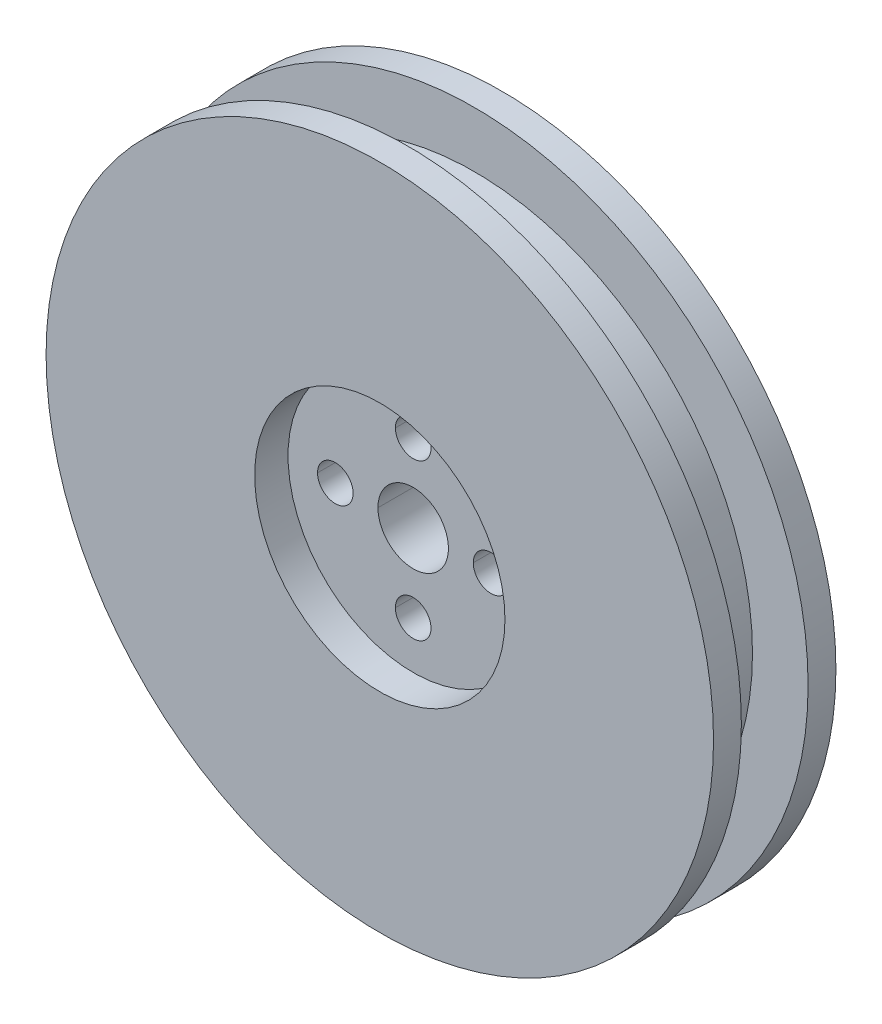
ISO-10303-21;
HEADER;
FILE_DESCRIPTION(('STEP AP214'),'2;1');
FILE_NAME('part.step','',(''),(''),'','','');
FILE_SCHEMA(('AUTOMOTIVE_DESIGN { 1 0 10303 214 1 1 1 1 }'));
ENDSEC;
DATA;
#1=APPLICATION_CONTEXT('core data for automotive mechanical design processes');
#2=APPLICATION_PROTOCOL_DEFINITION('international standard','automotive_design',2000,#1);
#3=PRODUCT_CONTEXT('',#1,'mechanical');
#4=PRODUCT('Part','Part','',(#3));
#5=PRODUCT_RELATED_PRODUCT_CATEGORY('part','',(#4));
#6=PRODUCT_DEFINITION_FORMATION('','',#4);
#7=PRODUCT_DEFINITION_CONTEXT('part definition',#1,'design');
#8=PRODUCT_DEFINITION('design','',#6,#7);
#9=PRODUCT_DEFINITION_SHAPE('','',#8);
#10=(LENGTH_UNIT() NAMED_UNIT(*) SI_UNIT(.MILLI.,.METRE.));
#11=(NAMED_UNIT(*) PLANE_ANGLE_UNIT() SI_UNIT($,.RADIAN.));
#12=(NAMED_UNIT(*) SI_UNIT($,.STERADIAN.) SOLID_ANGLE_UNIT());
#13=UNCERTAINTY_MEASURE_WITH_UNIT(LENGTH_MEASURE(1.E-05),#10,'distance_accuracy_value','');
#14=(GEOMETRIC_REPRESENTATION_CONTEXT(3) GLOBAL_UNCERTAINTY_ASSIGNED_CONTEXT((#13)) GLOBAL_UNIT_ASSIGNED_CONTEXT((#10,
#11,#12)) REPRESENTATION_CONTEXT('',''));
#15=CARTESIAN_POINT('',(0.,0.,0.));
#16=DIRECTION('',(0.,0.,1.));
#17=DIRECTION('',(1.,0.,0.));
#18=AXIS2_PLACEMENT_3D('',#15,#16,#17);
#19=CARTESIAN_POINT('',(0.,0.,-16.));
#20=DIRECTION('',(0.,0.,1.));
#21=DIRECTION('',(1.,0.,0.));
#22=AXIS2_PLACEMENT_3D('',#19,#20,#21);
#23=CYLINDRICAL_SURFACE('',#22,3.16810248006077);
#24=CARTESIAN_POINT('',(0.,0.,3.));
#25=DIRECTION('',(0.,0.,-1.));
#26=DIRECTION('',(-1.,0.,0.));
#27=AXIS2_PLACEMENT_3D('',#24,#25,#26);
#28=CIRCLE('',#27,3.16810248006077);
#29=CARTESIAN_POINT('',(-3.16810248006077,0.,3.));
#30=VERTEX_POINT('',#29);
#31=CARTESIAN_POINT('',(3.16810248006077,0.,3.));
#32=VERTEX_POINT('',#31);
#33=EDGE_CURVE('E56',#30,#32,#28,.F.);
#34=ORIENTED_EDGE('',*,*,#33,.F.);
#35=DIRECTION('',(0.,0.,1.));
#36=VECTOR('',#35,1.);
#37=CARTESIAN_POINT('',(-3.16810248006077,0.,-16.));
#38=LINE('',#37,#36);
#39=CARTESIAN_POINT('',(-3.16810248006077,0.,8.));
#40=VERTEX_POINT('',#39);
#41=EDGE_CURVE('E179',#30,#40,#38,.T.);
#42=ORIENTED_EDGE('',*,*,#41,.T.);
#43=CARTESIAN_POINT('',(0.,0.,8.));
#44=DIRECTION('',(0.,0.,-1.));
#45=DIRECTION('',(1.,0.,0.));
#46=AXIS2_PLACEMENT_3D('',#43,#44,#45);
#47=CIRCLE('',#46,3.16810248006077);
#48=CARTESIAN_POINT('',(3.16810248006077,0.,8.));
#49=VERTEX_POINT('',#48);
#50=EDGE_CURVE('E171',#49,#40,#47,.T.);
#51=ORIENTED_EDGE('',*,*,#50,.F.);
#52=DIRECTION('',(0.,0.,1.));
#53=VECTOR('',#52,1.);
#54=CARTESIAN_POINT('',(3.16810248006077,0.,-16.));
#55=LINE('',#54,#53);
#56=EDGE_CURVE('E43',#32,#49,#55,.T.);
#57=ORIENTED_EDGE('',*,*,#56,.F.);
#58=EDGE_LOOP('',(#34,#42,#51,#57));
#59=FACE_BOUND('',#58,.T.);
#60=ADVANCED_FACE('F39',(#59),#23,.F.);
#61=EDGE_CURVE('E222',#32,#30,#28,.F.);
#62=ORIENTED_EDGE('',*,*,#61,.F.);
#63=ORIENTED_EDGE('',*,*,#56,.T.);
#64=CARTESIAN_POINT('',(0.,0.,8.));
#65=DIRECTION('',(0.,0.,-1.));
#66=DIRECTION('',(1.,0.,0.));
#67=AXIS2_PLACEMENT_3D('',#64,#65,#66);
#68=CIRCLE('',#67,3.16810248006077);
#69=EDGE_CURVE('E188',#40,#49,#68,.T.);
#70=ORIENTED_EDGE('',*,*,#69,.F.);
#71=ORIENTED_EDGE('',*,*,#41,.F.);
#72=EDGE_LOOP('',(#62,#63,#70,#71));
#73=FACE_BOUND('',#72,.T.);
#74=ADVANCED_FACE('F221',(#73),#23,.F.);
#75=CARTESIAN_POINT('',(-7.,0.,-16.));
#76=DIRECTION('',(0.,0.,1.));
#77=DIRECTION('',(1.,0.,0.));
#78=AXIS2_PLACEMENT_3D('',#75,#76,#77);
#79=CYLINDRICAL_SURFACE('',#78,1.6);
#80=CARTESIAN_POINT('',(-7.,0.,3.));
#81=DIRECTION('',(0.,0.,-1.));
#82=DIRECTION('',(-1.,0.,0.));
#83=AXIS2_PLACEMENT_3D('',#80,#81,#82);
#84=CIRCLE('',#83,1.6);
#85=CARTESIAN_POINT('',(-5.4,0.,3.));
#86=VERTEX_POINT('',#85);
#87=CARTESIAN_POINT('',(-8.6,0.,3.));
#88=VERTEX_POINT('',#87);
#89=EDGE_CURVE('E63',#86,#88,#84,.F.);
#90=ORIENTED_EDGE('',*,*,#89,.F.);
#91=DIRECTION('',(0.,0.,1.));
#92=VECTOR('',#91,1.);
#93=CARTESIAN_POINT('',(-5.4,0.,-16.));
#94=LINE('',#93,#92);
#95=CARTESIAN_POINT('',(-5.4,0.,8.));
#96=VERTEX_POINT('',#95);
#97=EDGE_CURVE('E180',#86,#96,#94,.T.);
#98=ORIENTED_EDGE('',*,*,#97,.T.);
#99=CARTESIAN_POINT('',(-7.,0.,8.));
#100=DIRECTION('',(0.,0.,-1.));
#101=DIRECTION('',(1.,0.,0.));
#102=AXIS2_PLACEMENT_3D('',#99,#100,#101);
#103=CIRCLE('',#102,1.6);
#104=CARTESIAN_POINT('',(-8.6,0.,8.));
#105=VERTEX_POINT('',#104);
#106=EDGE_CURVE('E166',#105,#96,#103,.T.);
#107=ORIENTED_EDGE('',*,*,#106,.F.);
#108=DIRECTION('',(0.,0.,1.));
#109=VECTOR('',#108,1.);
#110=CARTESIAN_POINT('',(-8.6,0.,-16.));
#111=LINE('',#110,#109);
#112=EDGE_CURVE('E175',#88,#105,#111,.T.);
#113=ORIENTED_EDGE('',*,*,#112,.F.);
#114=EDGE_LOOP('',(#90,#98,#107,#113));
#115=FACE_BOUND('',#114,.T.);
#116=ADVANCED_FACE('F300',(#115),#79,.F.);
#117=CARTESIAN_POINT('',(-7.,0.,-16.));
#118=DIRECTION('',(0.,0.,1.));
#119=DIRECTION('',(1.,0.,0.));
#120=AXIS2_PLACEMENT_3D('',#117,#118,#119);
#121=CYLINDRICAL_SURFACE('',#120,1.6);
#122=CARTESIAN_POINT('',(-7.,0.,3.));
#123=DIRECTION('',(0.,0.,-1.));
#124=DIRECTION('',(-1.,0.,0.));
#125=AXIS2_PLACEMENT_3D('',#122,#123,#124);
#126=CIRCLE('',#125,1.6);
#127=EDGE_CURVE('E276',#88,#86,#126,.F.);
#128=ORIENTED_EDGE('',*,*,#127,.F.);
#129=ORIENTED_EDGE('',*,*,#112,.T.);
#130=CARTESIAN_POINT('',(-7.,0.,8.));
#131=DIRECTION('',(0.,0.,-1.));
#132=DIRECTION('',(1.,0.,0.));
#133=AXIS2_PLACEMENT_3D('',#130,#131,#132);
#134=CIRCLE('',#133,1.6);
#135=EDGE_CURVE('E170',#96,#105,#134,.T.);
#136=ORIENTED_EDGE('',*,*,#135,.F.);
#137=ORIENTED_EDGE('',*,*,#97,.F.);
#138=EDGE_LOOP('',(#128,#129,#136,#137));
#139=FACE_BOUND('',#138,.T.);
#140=ADVANCED_FACE('F306',(#139),#121,.F.);
#141=CARTESIAN_POINT('',(0.,-7.,-16.));
#142=DIRECTION('',(0.,0.,1.));
#143=DIRECTION('',(1.,0.,0.));
#144=AXIS2_PLACEMENT_3D('',#141,#142,#143);
#145=CYLINDRICAL_SURFACE('',#144,1.6);
#146=CARTESIAN_POINT('',(0.,-7.,3.));
#147=DIRECTION('',(0.,0.,-1.));
#148=DIRECTION('',(-1.,0.,0.));
#149=AXIS2_PLACEMENT_3D('',#146,#147,#148);
#150=CIRCLE('',#149,1.6);
#151=CARTESIAN_POINT('',(1.6,-7.,3.));
#152=VERTEX_POINT('',#151);
#153=CARTESIAN_POINT('',(-1.6,-7.,3.));
#154=VERTEX_POINT('',#153);
#155=EDGE_CURVE('E269',#152,#154,#150,.F.);
#156=ORIENTED_EDGE('',*,*,#155,.F.);
#157=DIRECTION('',(0.,0.,1.));
#158=VECTOR('',#157,1.);
#159=CARTESIAN_POINT('',(1.6,-7.,-16.));
#160=LINE('',#159,#158);
#161=CARTESIAN_POINT('',(1.6,-7.,8.));
#162=VERTEX_POINT('',#161);
#163=EDGE_CURVE('E152',#152,#162,#160,.T.);
#164=ORIENTED_EDGE('',*,*,#163,.T.);
#165=CARTESIAN_POINT('',(0.,-7.,8.));
#166=DIRECTION('',(0.,0.,-1.));
#167=DIRECTION('',(1.,0.,0.));
#168=AXIS2_PLACEMENT_3D('',#165,#166,#167);
#169=CIRCLE('',#168,1.6);
#170=CARTESIAN_POINT('',(-1.6,-7.,8.));
#171=VERTEX_POINT('',#170);
#172=EDGE_CURVE('E165',#171,#162,#169,.T.);
#173=ORIENTED_EDGE('',*,*,#172,.F.);
#174=DIRECTION('',(0.,0.,1.));
#175=VECTOR('',#174,1.);
#176=CARTESIAN_POINT('',(-1.6,-7.,-16.));
#177=LINE('',#176,#175);
#178=EDGE_CURVE('E178',#154,#171,#177,.T.);
#179=ORIENTED_EDGE('',*,*,#178,.F.);
#180=EDGE_LOOP('',(#156,#164,#173,#179));
#181=FACE_BOUND('',#180,.T.);
#182=ADVANCED_FACE('F267',(#181),#145,.F.);
#183=CARTESIAN_POINT('',(0.,-7.,-16.));
#184=DIRECTION('',(0.,0.,1.));
#185=DIRECTION('',(1.,0.,0.));
#186=AXIS2_PLACEMENT_3D('',#183,#184,#185);
#187=CYLINDRICAL_SURFACE('',#186,1.6);
#188=CARTESIAN_POINT('',(0.,-7.,3.));
#189=DIRECTION('',(0.,0.,-1.));
#190=DIRECTION('',(-1.,0.,0.));
#191=AXIS2_PLACEMENT_3D('',#188,#189,#190);
#192=CIRCLE('',#191,1.6);
#193=EDGE_CURVE('E273',#154,#152,#192,.F.);
#194=ORIENTED_EDGE('',*,*,#193,.F.);
#195=ORIENTED_EDGE('',*,*,#178,.T.);
#196=CARTESIAN_POINT('',(0.,-7.,8.));
#197=DIRECTION('',(0.,0.,-1.));
#198=DIRECTION('',(1.,0.,0.));
#199=AXIS2_PLACEMENT_3D('',#196,#197,#198);
#200=CIRCLE('',#199,1.6);
#201=EDGE_CURVE('E161',#162,#171,#200,.T.);
#202=ORIENTED_EDGE('',*,*,#201,.F.);
#203=ORIENTED_EDGE('',*,*,#163,.F.);
#204=EDGE_LOOP('',(#194,#195,#202,#203));
#205=FACE_BOUND('',#204,.T.);
#206=ADVANCED_FACE('F272',(#205),#187,.F.);
#207=CARTESIAN_POINT('',(7.,0.,-16.));
#208=DIRECTION('',(0.,0.,1.));
#209=DIRECTION('',(1.,0.,0.));
#210=AXIS2_PLACEMENT_3D('',#207,#208,#209);
#211=CYLINDRICAL_SURFACE('',#210,1.6);
#212=CARTESIAN_POINT('',(7.,0.,3.));
#213=DIRECTION('',(0.,0.,-1.));
#214=DIRECTION('',(-1.,0.,0.));
#215=AXIS2_PLACEMENT_3D('',#212,#213,#214);
#216=CIRCLE('',#215,1.6);
#217=CARTESIAN_POINT('',(8.6,0.,3.));
#218=VERTEX_POINT('',#217);
#219=CARTESIAN_POINT('',(5.4,0.,3.));
#220=VERTEX_POINT('',#219);
#221=EDGE_CURVE('E274',#218,#220,#216,.F.);
#222=ORIENTED_EDGE('',*,*,#221,.F.);
#223=DIRECTION('',(0.,0.,1.));
#224=VECTOR('',#223,1.);
#225=CARTESIAN_POINT('',(8.6,0.,-16.));
#226=LINE('',#225,#224);
#227=CARTESIAN_POINT('',(8.6,0.,8.));
#228=VERTEX_POINT('',#227);
#229=EDGE_CURVE('E146',#218,#228,#226,.T.);
#230=ORIENTED_EDGE('',*,*,#229,.T.);
#231=CARTESIAN_POINT('',(7.,0.,8.));
#232=DIRECTION('',(0.,0.,-1.));
#233=DIRECTION('',(1.,0.,0.));
#234=AXIS2_PLACEMENT_3D('',#231,#232,#233);
#235=CIRCLE('',#234,1.6);
#236=CARTESIAN_POINT('',(5.4,0.,8.));
#237=VERTEX_POINT('',#236);
#238=EDGE_CURVE('E158',#237,#228,#235,.T.);
#239=ORIENTED_EDGE('',*,*,#238,.F.);
#240=DIRECTION('',(0.,0.,1.));
#241=VECTOR('',#240,1.);
#242=CARTESIAN_POINT('',(5.4,0.,-16.));
#243=LINE('',#242,#241);
#244=EDGE_CURVE('E195',#220,#237,#243,.T.);
#245=ORIENTED_EDGE('',*,*,#244,.F.);
#246=EDGE_LOOP('',(#222,#230,#239,#245));
#247=FACE_BOUND('',#246,.T.);
#248=ADVANCED_FACE('F308',(#247),#211,.F.);
#249=CARTESIAN_POINT('',(7.,0.,-16.));
#250=DIRECTION('',(0.,0.,1.));
#251=DIRECTION('',(1.,0.,0.));
#252=AXIS2_PLACEMENT_3D('',#249,#250,#251);
#253=CYLINDRICAL_SURFACE('',#252,1.6);
#254=CARTESIAN_POINT('',(7.,0.,3.));
#255=DIRECTION('',(0.,0.,-1.));
#256=DIRECTION('',(-1.,0.,0.));
#257=AXIS2_PLACEMENT_3D('',#254,#255,#256);
#258=CIRCLE('',#257,1.6);
#259=EDGE_CURVE('E138',#220,#218,#258,.F.);
#260=ORIENTED_EDGE('',*,*,#259,.F.);
#261=ORIENTED_EDGE('',*,*,#244,.T.);
#262=CARTESIAN_POINT('',(7.,0.,8.));
#263=DIRECTION('',(0.,0.,-1.));
#264=DIRECTION('',(1.,0.,0.));
#265=AXIS2_PLACEMENT_3D('',#262,#263,#264);
#266=CIRCLE('',#265,1.6);
#267=EDGE_CURVE('E174',#228,#237,#266,.T.);
#268=ORIENTED_EDGE('',*,*,#267,.F.);
#269=ORIENTED_EDGE('',*,*,#229,.F.);
#270=EDGE_LOOP('',(#260,#261,#268,#269));
#271=FACE_BOUND('',#270,.T.);
#272=ADVANCED_FACE('F310',(#271),#253,.F.);
#273=CARTESIAN_POINT('',(0.,7.,-16.));
#274=DIRECTION('',(0.,0.,1.));
#275=DIRECTION('',(1.,0.,0.));
#276=AXIS2_PLACEMENT_3D('',#273,#274,#275);
#277=CYLINDRICAL_SURFACE('',#276,1.6);
#278=CARTESIAN_POINT('',(0.,7.,3.));
#279=DIRECTION('',(0.,0.,-1.));
#280=DIRECTION('',(-1.,0.,0.));
#281=AXIS2_PLACEMENT_3D('',#278,#279,#280);
#282=CIRCLE('',#281,1.6);
#283=CARTESIAN_POINT('',(1.6,7.,3.));
#284=VERTEX_POINT('',#283);
#285=CARTESIAN_POINT('',(-1.6,7.,3.));
#286=VERTEX_POINT('',#285);
#287=EDGE_CURVE('E130',#284,#286,#282,.F.);
#288=ORIENTED_EDGE('',*,*,#287,.F.);
#289=DIRECTION('',(0.,0.,1.));
#290=VECTOR('',#289,1.);
#291=CARTESIAN_POINT('',(1.6,7.,-16.));
#292=LINE('',#291,#290);
#293=CARTESIAN_POINT('',(1.6,7.,8.));
#294=VERTEX_POINT('',#293);
#295=EDGE_CURVE('E136',#284,#294,#292,.T.);
#296=ORIENTED_EDGE('',*,*,#295,.T.);
#297=CARTESIAN_POINT('',(0.,7.,8.));
#298=DIRECTION('',(0.,0.,-1.));
#299=DIRECTION('',(1.,0.,0.));
#300=AXIS2_PLACEMENT_3D('',#297,#298,#299);
#301=CIRCLE('',#300,1.6);
#302=CARTESIAN_POINT('',(-1.6,7.,8.));
#303=VERTEX_POINT('',#302);
#304=EDGE_CURVE('E155',#303,#294,#301,.T.);
#305=ORIENTED_EDGE('',*,*,#304,.F.);
#306=DIRECTION('',(0.,0.,1.));
#307=VECTOR('',#306,1.);
#308=CARTESIAN_POINT('',(-1.6,7.,-16.));
#309=LINE('',#308,#307);
#310=EDGE_CURVE('E49',#286,#303,#309,.T.);
#311=ORIENTED_EDGE('',*,*,#310,.F.);
#312=EDGE_LOOP('',(#288,#296,#305,#311));
#313=FACE_BOUND('',#312,.T.);
#314=ADVANCED_FACE('F41',(#313),#277,.F.);
#315=CARTESIAN_POINT('',(0.,7.,-16.));
#316=DIRECTION('',(0.,0.,1.));
#317=DIRECTION('',(1.,0.,0.));
#318=AXIS2_PLACEMENT_3D('',#315,#316,#317);
#319=CYLINDRICAL_SURFACE('',#318,1.6);
#320=CARTESIAN_POINT('',(0.,7.,3.));
#321=DIRECTION('',(0.,0.,-1.));
#322=DIRECTION('',(-1.,0.,0.));
#323=AXIS2_PLACEMENT_3D('',#320,#321,#322);
#324=CIRCLE('',#323,1.6);
#325=EDGE_CURVE('E11',#286,#284,#324,.F.);
#326=ORIENTED_EDGE('',*,*,#325,.F.);
#327=ORIENTED_EDGE('',*,*,#310,.T.);
#328=CARTESIAN_POINT('',(0.,7.,8.));
#329=DIRECTION('',(0.,0.,-1.));
#330=DIRECTION('',(1.,0.,0.));
#331=AXIS2_PLACEMENT_3D('',#328,#329,#330);
#332=CIRCLE('',#331,1.6);
#333=EDGE_CURVE('E143',#294,#303,#332,.T.);
#334=ORIENTED_EDGE('',*,*,#333,.F.);
#335=ORIENTED_EDGE('',*,*,#295,.F.);
#336=EDGE_LOOP('',(#326,#327,#334,#335));
#337=FACE_BOUND('',#336,.T.);
#338=ADVANCED_FACE('F141',(#337),#319,.F.);
#339=CARTESIAN_POINT('',(0.,0.,8.));
#340=DIRECTION('',(0.,0.,1.));
#341=DIRECTION('',(1.,0.,0.));
#342=AXIS2_PLACEMENT_3D('',#339,#340,#341);
#343=PLANE('',#342);
#344=ORIENTED_EDGE('',*,*,#333,.T.);
#345=ORIENTED_EDGE('',*,*,#304,.T.);
#346=EDGE_LOOP('',(#344,#345));
#347=FACE_BOUND('',#346,.T.);
#348=ORIENTED_EDGE('',*,*,#267,.T.);
#349=ORIENTED_EDGE('',*,*,#238,.T.);
#350=EDGE_LOOP('',(#348,#349));
#351=FACE_BOUND('',#350,.T.);
#352=ORIENTED_EDGE('',*,*,#201,.T.);
#353=ORIENTED_EDGE('',*,*,#172,.T.);
#354=EDGE_LOOP('',(#352,#353));
#355=FACE_BOUND('',#354,.T.);
#356=ORIENTED_EDGE('',*,*,#135,.T.);
#357=ORIENTED_EDGE('',*,*,#106,.T.);
#358=EDGE_LOOP('',(#356,#357));
#359=FACE_BOUND('',#358,.T.);
#360=ORIENTED_EDGE('',*,*,#50,.T.);
#361=ORIENTED_EDGE('',*,*,#69,.T.);
#362=EDGE_LOOP('',(#360,#361));
#363=FACE_BOUND('',#362,.T.);
#364=CARTESIAN_POINT('',(0.,0.,8.));
#365=DIRECTION('',(0.,0.,1.));
#366=DIRECTION('',(1.,0.,0.));
#367=AXIS2_PLACEMENT_3D('',#364,#365,#366);
#368=CIRCLE('',#367,11.25);
#369=CARTESIAN_POINT('',(11.25,0.,8.));
#370=VERTEX_POINT('',#369);
#371=EDGE_CURVE('E232',#370,#370,#368,.T.);
#372=ORIENTED_EDGE('',*,*,#371,.T.);
#373=EDGE_LOOP('',(#372));
#374=FACE_BOUND('',#373,.T.);
#375=ADVANCED_FACE('F224',(#347,#351,#355,#359,#363,#374),#343,.T.);
#376=CARTESIAN_POINT('',(0.,0.,8.));
#377=DIRECTION('',(0.,0.,1.));
#378=DIRECTION('',(1.,0.,0.));
#379=AXIS2_PLACEMENT_3D('',#376,#377,#378);
#380=CYLINDRICAL_SURFACE('',#379,11.25);
#381=ORIENTED_EDGE('',*,*,#371,.F.);
#382=EDGE_LOOP('',(#381));
#383=FACE_BOUND('',#382,.T.);
#384=CARTESIAN_POINT('',(0.,0.,11.));
#385=DIRECTION('',(0.,0.,1.));
#386=DIRECTION('',(1.,0.,0.));
#387=AXIS2_PLACEMENT_3D('',#384,#385,#386);
#388=CIRCLE('',#387,11.25);
#389=CARTESIAN_POINT('',(11.25,0.,11.));
#390=VERTEX_POINT('',#389);
#391=EDGE_CURVE('E235',#390,#390,#388,.T.);
#392=ORIENTED_EDGE('',*,*,#391,.T.);
#393=EDGE_LOOP('',(#392));
#394=FACE_BOUND('',#393,.T.);
#395=ADVANCED_FACE('F227',(#383,#394),#380,.F.);
#396=CARTESIAN_POINT('',(0.,0.,-11.));
#397=DIRECTION('',(0.,0.,1.));
#398=DIRECTION('',(1.,0.,0.));
#399=AXIS2_PLACEMENT_3D('',#396,#397,#398);
#400=CYLINDRICAL_SURFACE('',#399,25.);
#401=CARTESIAN_POINT('',(0.,0.,8.5));
#402=DIRECTION('',(0.,0.,1.));
#403=DIRECTION('',(1.,0.,0.));
#404=AXIS2_PLACEMENT_3D('',#401,#402,#403);
#405=CIRCLE('',#404,25.);
#406=CARTESIAN_POINT('',(25.,0.,8.5));
#407=VERTEX_POINT('',#406);
#408=EDGE_CURVE('E192',#407,#407,#405,.F.);
#409=ORIENTED_EDGE('',*,*,#408,.T.);
#410=EDGE_LOOP('',(#409));
#411=FACE_BOUND('',#410,.T.);
#412=CARTESIAN_POINT('',(0.,0.,2.5));
#413=DIRECTION('',(0.,0.,-1.));
#414=DIRECTION('',(-1.,0.,0.));
#415=AXIS2_PLACEMENT_3D('',#412,#413,#414);
#416=CIRCLE('',#415,25.);
#417=CARTESIAN_POINT('',(-25.,0.,2.5));
#418=VERTEX_POINT('',#417);
#419=EDGE_CURVE('E246',#418,#418,#416,.F.);
#420=ORIENTED_EDGE('',*,*,#419,.T.);
#421=EDGE_LOOP('',(#420));
#422=FACE_BOUND('',#421,.T.);
#423=ADVANCED_FACE('F440',(#411,#422),#400,.T.);
#424=CARTESIAN_POINT('',(0.,0.,8.5));
#425=DIRECTION('',(0.,0.,1.));
#426=DIRECTION('',(1.,0.,0.));
#427=AXIS2_PLACEMENT_3D('',#424,#425,#426);
#428=PLANE('',#427);
#429=ORIENTED_EDGE('',*,*,#408,.F.);
#430=EDGE_LOOP('',(#429));
#431=FACE_BOUND('',#430,.T.);
#432=CARTESIAN_POINT('',(0.,0.,8.5));
#433=DIRECTION('',(0.,0.,1.));
#434=DIRECTION('',(1.,0.,0.));
#435=AXIS2_PLACEMENT_3D('',#432,#433,#434);
#436=CIRCLE('',#435,30.);
#437=CARTESIAN_POINT('',(30.,0.,8.5));
#438=VERTEX_POINT('',#437);
#439=EDGE_CURVE('E206',#438,#438,#436,.T.);
#440=ORIENTED_EDGE('',*,*,#439,.F.);
#441=EDGE_LOOP('',(#440));
#442=FACE_BOUND('',#441,.T.);
#443=ADVANCED_FACE('F562',(#431,#442),#428,.F.);
#444=CARTESIAN_POINT('',(0.,0.,8.5));
#445=DIRECTION('',(0.,0.,1.));
#446=DIRECTION('',(1.,0.,0.));
#447=AXIS2_PLACEMENT_3D('',#444,#445,#446);
#448=CYLINDRICAL_SURFACE('',#447,30.);
#449=ORIENTED_EDGE('',*,*,#439,.T.);
#450=EDGE_LOOP('',(#449));
#451=FACE_BOUND('',#450,.T.);
#452=CARTESIAN_POINT('',(0.,0.,11.));
#453=DIRECTION('',(0.,0.,1.));
#454=DIRECTION('',(1.,0.,0.));
#455=AXIS2_PLACEMENT_3D('',#452,#453,#454);
#456=CIRCLE('',#455,30.);
#457=CARTESIAN_POINT('',(30.,0.,11.));
#458=VERTEX_POINT('',#457);
#459=EDGE_CURVE('E250',#458,#458,#456,.T.);
#460=ORIENTED_EDGE('',*,*,#459,.F.);
#461=EDGE_LOOP('',(#460));
#462=FACE_BOUND('',#461,.T.);
#463=ADVANCED_FACE('F404',(#451,#462),#448,.T.);
#464=CARTESIAN_POINT('',(0.,0.,11.));
#465=DIRECTION('',(0.,0.,1.));
#466=DIRECTION('',(1.,0.,0.));
#467=AXIS2_PLACEMENT_3D('',#464,#465,#466);
#468=PLANE('',#467);
#469=ORIENTED_EDGE('',*,*,#391,.F.);
#470=EDGE_LOOP('',(#469));
#471=FACE_BOUND('',#470,.T.);
#472=ORIENTED_EDGE('',*,*,#459,.T.);
#473=EDGE_LOOP('',(#472));
#474=FACE_BOUND('',#473,.T.);
#475=ADVANCED_FACE('F303',(#471,#474),#468,.T.);
#476=CARTESIAN_POINT('',(0.,0.,2.5));
#477=DIRECTION('',(0.,0.,-1.));
#478=DIRECTION('',(-1.,0.,0.));
#479=AXIS2_PLACEMENT_3D('',#476,#477,#478);
#480=CYLINDRICAL_SURFACE('',#479,30.);
#481=CARTESIAN_POINT('',(0.,0.,2.5));
#482=DIRECTION('',(0.,0.,-1.));
#483=DIRECTION('',(-1.,0.,0.));
#484=AXIS2_PLACEMENT_3D('',#481,#482,#483);
#485=CIRCLE('',#484,30.);
#486=CARTESIAN_POINT('',(-30.,0.,2.5));
#487=VERTEX_POINT('',#486);
#488=EDGE_CURVE('E238',#487,#487,#485,.T.);
#489=ORIENTED_EDGE('',*,*,#488,.T.);
#490=EDGE_LOOP('',(#489));
#491=FACE_BOUND('',#490,.T.);
#492=CARTESIAN_POINT('',(0.,0.,0.));
#493=DIRECTION('',(0.,0.,-1.));
#494=DIRECTION('',(-1.,0.,0.));
#495=AXIS2_PLACEMENT_3D('',#492,#493,#494);
#496=CIRCLE('',#495,30.);
#497=CARTESIAN_POINT('',(-30.,0.,0.));
#498=VERTEX_POINT('',#497);
#499=EDGE_CURVE('E234',#498,#498,#496,.T.);
#500=ORIENTED_EDGE('',*,*,#499,.F.);
#501=EDGE_LOOP('',(#500));
#502=FACE_BOUND('',#501,.T.);
#503=ADVANCED_FACE('F403',(#491,#502),#480,.T.);
#504=CARTESIAN_POINT('',(0.,0.,2.5));
#505=DIRECTION('',(0.,0.,-1.));
#506=DIRECTION('',(-1.,0.,0.));
#507=AXIS2_PLACEMENT_3D('',#504,#505,#506);
#508=PLANE('',#507);
#509=ORIENTED_EDGE('',*,*,#419,.F.);
#510=EDGE_LOOP('',(#509));
#511=FACE_BOUND('',#510,.T.);
#512=ORIENTED_EDGE('',*,*,#488,.F.);
#513=EDGE_LOOP('',(#512));
#514=FACE_BOUND('',#513,.T.);
#515=ADVANCED_FACE('F291',(#511,#514),#508,.F.);
#516=CARTESIAN_POINT('',(0.,0.,0.));
#517=DIRECTION('',(0.,0.,1.));
#518=DIRECTION('',(1.,0.,0.));
#519=AXIS2_PLACEMENT_3D('',#516,#517,#518);
#520=PLANE('',#519);
#521=CARTESIAN_POINT('',(0.,0.,0.));
#522=DIRECTION('',(0.,0.,-1.));
#523=DIRECTION('',(-1.,0.,0.));
#524=AXIS2_PLACEMENT_3D('',#521,#522,#523);
#525=CIRCLE('',#524,11.25);
#526=CARTESIAN_POINT('',(-11.25,0.,0.));
#527=VERTEX_POINT('',#526);
#528=EDGE_CURVE('E622',#527,#527,#525,.T.);
#529=ORIENTED_EDGE('',*,*,#528,.F.);
#530=EDGE_LOOP('',(#529));
#531=FACE_BOUND('',#530,.T.);
#532=ORIENTED_EDGE('',*,*,#499,.T.);
#533=EDGE_LOOP('',(#532));
#534=FACE_BOUND('',#533,.T.);
#535=ADVANCED_FACE('F283',(#531,#534),#520,.F.);
#536=CARTESIAN_POINT('',(0.,0.,3.));
#537=DIRECTION('',(0.,0.,-1.));
#538=DIRECTION('',(-1.,0.,0.));
#539=AXIS2_PLACEMENT_3D('',#536,#537,#538);
#540=PLANE('',#539);
#541=ORIENTED_EDGE('',*,*,#89,.T.);
#542=ORIENTED_EDGE('',*,*,#127,.T.);
#543=EDGE_LOOP('',(#541,#542));
#544=FACE_BOUND('',#543,.T.);
#545=ORIENTED_EDGE('',*,*,#221,.T.);
#546=ORIENTED_EDGE('',*,*,#259,.T.);
#547=EDGE_LOOP('',(#545,#546));
#548=FACE_BOUND('',#547,.T.);
#549=CARTESIAN_POINT('',(0.,0.,3.));
#550=DIRECTION('',(0.,0.,-1.));
#551=DIRECTION('',(-1.,0.,0.));
#552=AXIS2_PLACEMENT_3D('',#549,#550,#551);
#553=CIRCLE('',#552,11.25);
#554=CARTESIAN_POINT('',(-11.25,0.,3.));
#555=VERTEX_POINT('',#554);
#556=EDGE_CURVE('E139',#555,#555,#553,.T.);
#557=ORIENTED_EDGE('',*,*,#556,.T.);
#558=EDGE_LOOP('',(#557));
#559=FACE_BOUND('',#558,.T.);
#560=ORIENTED_EDGE('',*,*,#287,.T.);
#561=ORIENTED_EDGE('',*,*,#325,.T.);
#562=EDGE_LOOP('',(#560,#561));
#563=FACE_BOUND('',#562,.T.);
#564=ORIENTED_EDGE('',*,*,#155,.T.);
#565=ORIENTED_EDGE('',*,*,#193,.T.);
#566=EDGE_LOOP('',(#564,#565));
#567=FACE_BOUND('',#566,.T.);
#568=ORIENTED_EDGE('',*,*,#33,.T.);
#569=ORIENTED_EDGE('',*,*,#61,.T.);
#570=EDGE_LOOP('',(#568,#569));
#571=FACE_BOUND('',#570,.T.);
#572=ADVANCED_FACE('F128',(#544,#548,#559,#563,#567,#571),#540,.T.);
#573=CARTESIAN_POINT('',(0.,0.,3.));
#574=DIRECTION('',(0.,0.,-1.));
#575=DIRECTION('',(-1.,0.,0.));
#576=AXIS2_PLACEMENT_3D('',#573,#574,#575);
#577=CYLINDRICAL_SURFACE('',#576,11.25);
#578=ORIENTED_EDGE('',*,*,#556,.F.);
#579=EDGE_LOOP('',(#578));
#580=FACE_BOUND('',#579,.T.);
#581=ORIENTED_EDGE('',*,*,#528,.T.);
#582=EDGE_LOOP('',(#581));
#583=FACE_BOUND('',#582,.T.);
#584=ADVANCED_FACE('F282',(#580,#583),#577,.F.);
#585=CLOSED_SHELL('',(#60,#74,#116,#140,#182,#206,#248,#272,#314,#338,#375,#395,#423,#443,#463,
#475,#503,#515,#535,#572,#584));
#586=MANIFOLD_SOLID_BREP('B2',#585);
#587=ADVANCED_BREP_SHAPE_REPRESENTATION('',(#18,#586),#14);
#588=SHAPE_DEFINITION_REPRESENTATION(#9,#587);
ENDSEC;
END-ISO-10303-21;
